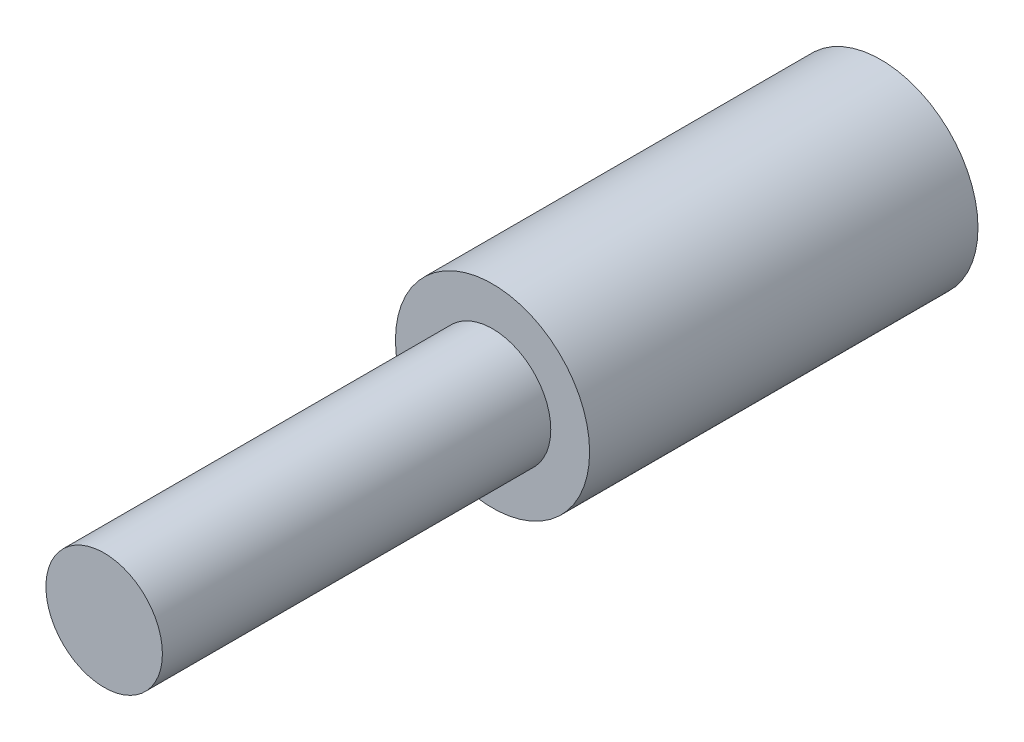
ISO-10303-21;
HEADER;
FILE_DESCRIPTION(('STEP AP214'),'2;1');
FILE_NAME('part.step','',(''),(''),'','','');
FILE_SCHEMA(('AUTOMOTIVE_DESIGN { 1 0 10303 214 1 1 1 1 }'));
ENDSEC;
DATA;
#1=APPLICATION_CONTEXT('core data for automotive mechanical design processes');
#2=APPLICATION_PROTOCOL_DEFINITION('international standard','automotive_design',2000,#1);
#3=PRODUCT_CONTEXT('',#1,'mechanical');
#4=PRODUCT('Part','Part','',(#3));
#5=PRODUCT_RELATED_PRODUCT_CATEGORY('part','',(#4));
#6=PRODUCT_DEFINITION_FORMATION('','',#4);
#7=PRODUCT_DEFINITION_CONTEXT('part definition',#1,'design');
#8=PRODUCT_DEFINITION('design','',#6,#7);
#9=PRODUCT_DEFINITION_SHAPE('','',#8);
#10=(LENGTH_UNIT() NAMED_UNIT(*) SI_UNIT(.MILLI.,.METRE.));
#11=(NAMED_UNIT(*) PLANE_ANGLE_UNIT() SI_UNIT($,.RADIAN.));
#12=(NAMED_UNIT(*) SI_UNIT($,.STERADIAN.) SOLID_ANGLE_UNIT());
#13=UNCERTAINTY_MEASURE_WITH_UNIT(LENGTH_MEASURE(1.E-05),#10,'distance_accuracy_value','');
#14=(GEOMETRIC_REPRESENTATION_CONTEXT(3) GLOBAL_UNCERTAINTY_ASSIGNED_CONTEXT((#13)) GLOBAL_UNIT_ASSIGNED_CONTEXT((#10,
#11,#12)) REPRESENTATION_CONTEXT('',''));
#15=CARTESIAN_POINT('',(0.,0.,0.));
#16=DIRECTION('',(0.,0.,1.));
#17=DIRECTION('',(1.,0.,0.));
#18=AXIS2_PLACEMENT_3D('',#15,#16,#17);
#19=CARTESIAN_POINT('',(0.,0.,100.));
#20=DIRECTION('',(0.,0.,-1.));
#21=DIRECTION('',(-1.,0.,0.));
#22=AXIS2_PLACEMENT_3D('',#19,#20,#21);
#23=CYLINDRICAL_SURFACE('',#22,25.);
#24=CARTESIAN_POINT('',(0.,0.,100.));
#25=DIRECTION('',(0.,0.,1.));
#26=DIRECTION('',(1.,0.,0.));
#27=AXIS2_PLACEMENT_3D('',#24,#25,#26);
#28=CIRCLE('',#27,25.);
#29=CARTESIAN_POINT('',(25.,0.,100.));
#30=VERTEX_POINT('',#29);
#31=EDGE_CURVE('E40',#30,#30,#28,.T.);
#32=ORIENTED_EDGE('',*,*,#31,.F.);
#33=EDGE_LOOP('',(#32));
#34=FACE_BOUND('',#33,.T.);
#35=CARTESIAN_POINT('',(0.,0.,0.));
#36=DIRECTION('',(0.,0.,1.));
#37=DIRECTION('',(1.,0.,0.));
#38=AXIS2_PLACEMENT_3D('',#35,#36,#37);
#39=CIRCLE('',#38,25.);
#40=CARTESIAN_POINT('',(25.,0.,0.));
#41=VERTEX_POINT('',#40);
#42=EDGE_CURVE('E36',#41,#41,#39,.T.);
#43=ORIENTED_EDGE('',*,*,#42,.T.);
#44=EDGE_LOOP('',(#43));
#45=FACE_BOUND('',#44,.T.);
#46=ADVANCED_FACE('F33',(#34,#45),#23,.T.);
#47=CARTESIAN_POINT('',(0.,0.,100.));
#48=DIRECTION('',(0.,0.,1.));
#49=DIRECTION('',(1.,0.,0.));
#50=AXIS2_PLACEMENT_3D('',#47,#48,#49);
#51=PLANE('',#50);
#52=CARTESIAN_POINT('',(0.,0.,100.));
#53=DIRECTION('',(0.,0.,1.));
#54=DIRECTION('',(1.,0.,0.));
#55=AXIS2_PLACEMENT_3D('',#52,#53,#54);
#56=CIRCLE('',#55,15.);
#57=CARTESIAN_POINT('',(15.,0.,100.));
#58=VERTEX_POINT('',#57);
#59=EDGE_CURVE('E10',#58,#58,#56,.T.);
#60=ORIENTED_EDGE('',*,*,#59,.F.);
#61=EDGE_LOOP('',(#60));
#62=FACE_BOUND('',#61,.T.);
#63=ORIENTED_EDGE('',*,*,#31,.T.);
#64=EDGE_LOOP('',(#63));
#65=FACE_BOUND('',#64,.T.);
#66=ADVANCED_FACE('F57',(#62,#65),#51,.T.);
#67=CARTESIAN_POINT('',(0.,0.,0.));
#68=DIRECTION('',(0.,0.,1.));
#69=DIRECTION('',(1.,0.,0.));
#70=AXIS2_PLACEMENT_3D('',#67,#68,#69);
#71=PLANE('',#70);
#72=ORIENTED_EDGE('',*,*,#42,.F.);
#73=EDGE_LOOP('',(#72));
#74=FACE_BOUND('',#73,.T.);
#75=ADVANCED_FACE('F54',(#74),#71,.F.);
#76=CARTESIAN_POINT('',(0.,0.,200.));
#77=DIRECTION('',(0.,0.,-1.));
#78=DIRECTION('',(-1.,0.,0.));
#79=AXIS2_PLACEMENT_3D('',#76,#77,#78);
#80=CYLINDRICAL_SURFACE('',#79,15.);
#81=CARTESIAN_POINT('',(0.,0.,200.));
#82=DIRECTION('',(0.,0.,1.));
#83=DIRECTION('',(1.,0.,0.));
#84=AXIS2_PLACEMENT_3D('',#81,#82,#83);
#85=CIRCLE('',#84,15.);
#86=CARTESIAN_POINT('',(15.,0.,200.));
#87=VERTEX_POINT('',#86);
#88=EDGE_CURVE('E46',#87,#87,#85,.T.);
#89=ORIENTED_EDGE('',*,*,#88,.F.);
#90=EDGE_LOOP('',(#89));
#91=FACE_BOUND('',#90,.T.);
#92=ORIENTED_EDGE('',*,*,#59,.T.);
#93=EDGE_LOOP('',(#92));
#94=FACE_BOUND('',#93,.T.);
#95=ADVANCED_FACE('F56',(#91,#94),#80,.T.);
#96=CARTESIAN_POINT('',(0.,0.,200.));
#97=DIRECTION('',(0.,0.,1.));
#98=DIRECTION('',(1.,0.,0.));
#99=AXIS2_PLACEMENT_3D('',#96,#97,#98);
#100=PLANE('',#99);
#101=ORIENTED_EDGE('',*,*,#88,.T.);
#102=EDGE_LOOP('',(#101));
#103=FACE_BOUND('',#102,.T.);
#104=ADVANCED_FACE('F62',(#103),#100,.T.);
#105=CLOSED_SHELL('',(#46,#66,#75,#95,#104));
#106=MANIFOLD_SOLID_BREP('B2',#105);
#107=ADVANCED_BREP_SHAPE_REPRESENTATION('',(#18,#106),#14);
#108=SHAPE_DEFINITION_REPRESENTATION(#9,#107);
ENDSEC;
END-ISO-10303-21;
